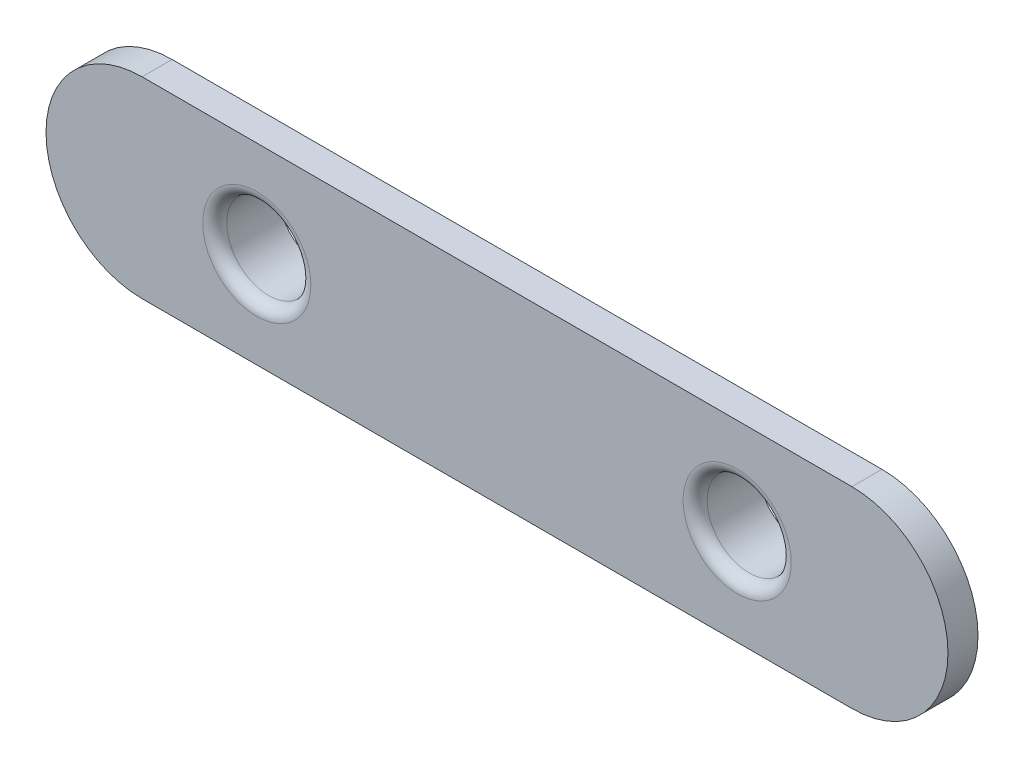
ISO-10303-21;
HEADER;
FILE_DESCRIPTION(('STEP AP214'),'2;1');
FILE_NAME('part.step','',(''),(''),'','','');
FILE_SCHEMA(('AUTOMOTIVE_DESIGN { 1 0 10303 214 1 1 1 1 }'));
ENDSEC;
DATA;
#1=APPLICATION_CONTEXT('core data for automotive mechanical design processes');
#2=APPLICATION_PROTOCOL_DEFINITION('international standard','automotive_design',2000,#1);
#3=PRODUCT_CONTEXT('',#1,'mechanical');
#4=PRODUCT('Part','Part','',(#3));
#5=PRODUCT_RELATED_PRODUCT_CATEGORY('part','',(#4));
#6=PRODUCT_DEFINITION_FORMATION('','',#4);
#7=PRODUCT_DEFINITION_CONTEXT('part definition',#1,'design');
#8=PRODUCT_DEFINITION('design','',#6,#7);
#9=PRODUCT_DEFINITION_SHAPE('','',#8);
#10=(LENGTH_UNIT() NAMED_UNIT(*) SI_UNIT(.MILLI.,.METRE.));
#11=(NAMED_UNIT(*) PLANE_ANGLE_UNIT() SI_UNIT($,.RADIAN.));
#12=(NAMED_UNIT(*) SI_UNIT($,.STERADIAN.) SOLID_ANGLE_UNIT());
#13=UNCERTAINTY_MEASURE_WITH_UNIT(LENGTH_MEASURE(1.E-05),#10,'distance_accuracy_value','');
#14=(GEOMETRIC_REPRESENTATION_CONTEXT(3) GLOBAL_UNCERTAINTY_ASSIGNED_CONTEXT((#13)) GLOBAL_UNIT_ASSIGNED_CONTEXT((#10,
#11,#12)) REPRESENTATION_CONTEXT('',''));
#15=CARTESIAN_POINT('',(0.,0.,0.));
#16=DIRECTION('',(0.,0.,1.));
#17=DIRECTION('',(1.,0.,0.));
#18=AXIS2_PLACEMENT_3D('',#15,#16,#17);
#19=CARTESIAN_POINT('',(-29.55,0.,0.));
#20=DIRECTION('',(0.,0.,1.));
#21=DIRECTION('',(1.,0.,0.));
#22=AXIS2_PLACEMENT_3D('',#19,#20,#21);
#23=PLANE('',#22);
#24=CARTESIAN_POINT('',(20.,0.,0.));
#25=DIRECTION('',(0.,0.,1.));
#26=DIRECTION('',(1.,0.,0.));
#27=AXIS2_PLACEMENT_3D('',#24,#25,#26);
#28=CIRCLE('',#27,4.5);
#29=CARTESIAN_POINT('',(24.5,0.,0.));
#30=VERTEX_POINT('',#29);
#31=EDGE_CURVE('E94',#30,#30,#28,.F.);
#32=ORIENTED_EDGE('',*,*,#31,.F.);
#33=EDGE_LOOP('',(#32));
#34=FACE_BOUND('',#33,.T.);
#35=CARTESIAN_POINT('',(-29.55,0.,0.));
#36=DIRECTION('',(0.,0.,1.));
#37=DIRECTION('',(1.,0.,0.));
#38=AXIS2_PLACEMENT_3D('',#35,#36,#37);
#39=CIRCLE('',#38,8.);
#40=CARTESIAN_POINT('',(-29.55,7.99999999999999,0.));
#41=VERTEX_POINT('',#40);
#42=CARTESIAN_POINT('',(-29.55,-8.00000000000001,0.));
#43=VERTEX_POINT('',#42);
#44=EDGE_CURVE('E84',#41,#43,#39,.T.);
#45=ORIENTED_EDGE('',*,*,#44,.F.);
#46=DIRECTION('',(-1.,0.,0.));
#47=VECTOR('',#46,1.);
#48=CARTESIAN_POINT('',(-29.55,7.99999999999999,0.));
#49=LINE('',#48,#47);
#50=CARTESIAN_POINT('',(29.55,7.99999999999999,0.));
#51=VERTEX_POINT('',#50);
#52=EDGE_CURVE('E56',#51,#41,#49,.T.);
#53=ORIENTED_EDGE('',*,*,#52,.F.);
#54=CARTESIAN_POINT('',(29.55,0.,0.));
#55=DIRECTION('',(0.,0.,1.));
#56=DIRECTION('',(1.,0.,0.));
#57=AXIS2_PLACEMENT_3D('',#54,#55,#56);
#58=CIRCLE('',#57,8.);
#59=CARTESIAN_POINT('',(29.55,-7.99999999999999,0.));
#60=VERTEX_POINT('',#59);
#61=EDGE_CURVE('E50',#60,#51,#58,.T.);
#62=ORIENTED_EDGE('',*,*,#61,.F.);
#63=DIRECTION('',(1.,0.,0.));
#64=VECTOR('',#63,1.);
#65=CARTESIAN_POINT('',(-29.55,-8.00000000000001,0.));
#66=LINE('',#65,#64);
#67=EDGE_CURVE('E74',#43,#60,#66,.T.);
#68=ORIENTED_EDGE('',*,*,#67,.F.);
#69=EDGE_LOOP('',(#45,#53,#62,#68));
#70=FACE_BOUND('',#69,.T.);
#71=CARTESIAN_POINT('',(-20.,0.,0.));
#72=DIRECTION('',(0.,0.,1.));
#73=DIRECTION('',(1.,0.,0.));
#74=AXIS2_PLACEMENT_3D('',#71,#72,#73);
#75=CIRCLE('',#74,4.5);
#76=CARTESIAN_POINT('',(-15.5,0.,0.));
#77=VERTEX_POINT('',#76);
#78=EDGE_CURVE('E97',#77,#77,#75,.F.);
#79=ORIENTED_EDGE('',*,*,#78,.F.);
#80=EDGE_LOOP('',(#79));
#81=FACE_BOUND('',#80,.T.);
#82=ADVANCED_FACE('F16',(#34,#70,#81),#23,.F.);
#83=CARTESIAN_POINT('',(-29.55,0.,2.5));
#84=DIRECTION('',(0.,0.,1.));
#85=DIRECTION('',(1.,0.,0.));
#86=AXIS2_PLACEMENT_3D('',#83,#84,#85);
#87=PLANE('',#86);
#88=CARTESIAN_POINT('',(20.,0.,2.5));
#89=DIRECTION('',(0.,0.,1.));
#90=DIRECTION('',(1.,0.,0.));
#91=AXIS2_PLACEMENT_3D('',#88,#89,#90);
#92=CIRCLE('',#91,4.5);
#93=CARTESIAN_POINT('',(24.5,0.,2.5));
#94=VERTEX_POINT('',#93);
#95=EDGE_CURVE('E25',#94,#94,#92,.F.);
#96=ORIENTED_EDGE('',*,*,#95,.T.);
#97=EDGE_LOOP('',(#96));
#98=FACE_BOUND('',#97,.T.);
#99=CARTESIAN_POINT('',(-20.,0.,2.5));
#100=DIRECTION('',(0.,0.,1.));
#101=DIRECTION('',(1.,0.,0.));
#102=AXIS2_PLACEMENT_3D('',#99,#100,#101);
#103=CIRCLE('',#102,4.5);
#104=CARTESIAN_POINT('',(-15.5,0.,2.5));
#105=VERTEX_POINT('',#104);
#106=EDGE_CURVE('E103',#105,#105,#103,.F.);
#107=ORIENTED_EDGE('',*,*,#106,.T.);
#108=EDGE_LOOP('',(#107));
#109=FACE_BOUND('',#108,.T.);
#110=CARTESIAN_POINT('',(-29.55,0.,2.5));
#111=DIRECTION('',(0.,0.,1.));
#112=DIRECTION('',(1.,0.,0.));
#113=AXIS2_PLACEMENT_3D('',#110,#111,#112);
#114=CIRCLE('',#113,8.);
#115=CARTESIAN_POINT('',(-29.55,7.99999999999999,2.5));
#116=VERTEX_POINT('',#115);
#117=CARTESIAN_POINT('',(-29.55,-8.00000000000001,2.5));
#118=VERTEX_POINT('',#117);
#119=EDGE_CURVE('E69',#116,#118,#114,.T.);
#120=ORIENTED_EDGE('',*,*,#119,.T.);
#121=DIRECTION('',(1.,0.,0.));
#122=VECTOR('',#121,1.);
#123=CARTESIAN_POINT('',(-29.55,-8.00000000000001,2.5));
#124=LINE('',#123,#122);
#125=CARTESIAN_POINT('',(29.55,-7.99999999999999,2.5));
#126=VERTEX_POINT('',#125);
#127=EDGE_CURVE('E64',#118,#126,#124,.T.);
#128=ORIENTED_EDGE('',*,*,#127,.T.);
#129=CARTESIAN_POINT('',(29.55,0.,2.5));
#130=DIRECTION('',(0.,0.,1.));
#131=DIRECTION('',(1.,0.,0.));
#132=AXIS2_PLACEMENT_3D('',#129,#130,#131);
#133=CIRCLE('',#132,8.);
#134=CARTESIAN_POINT('',(29.55,7.99999999999999,2.5));
#135=VERTEX_POINT('',#134);
#136=EDGE_CURVE('E67',#126,#135,#133,.T.);
#137=ORIENTED_EDGE('',*,*,#136,.T.);
#138=DIRECTION('',(-1.,0.,0.));
#139=VECTOR('',#138,1.);
#140=CARTESIAN_POINT('',(-29.55,7.99999999999999,2.5));
#141=LINE('',#140,#139);
#142=EDGE_CURVE('E33',#135,#116,#141,.T.);
#143=ORIENTED_EDGE('',*,*,#142,.T.);
#144=EDGE_LOOP('',(#120,#128,#137,#143));
#145=FACE_BOUND('',#144,.T.);
#146=ADVANCED_FACE('F65',(#98,#109,#145),#87,.T.);
#147=CARTESIAN_POINT('',(-29.55,0.,2.5));
#148=DIRECTION('',(0.,0.,-1.));
#149=DIRECTION('',(-1.,0.,0.));
#150=AXIS2_PLACEMENT_3D('',#147,#148,#149);
#151=CYLINDRICAL_SURFACE('',#150,8.);
#152=ORIENTED_EDGE('',*,*,#44,.T.);
#153=DIRECTION('',(0.,0.,-1.));
#154=VECTOR('',#153,1.);
#155=CARTESIAN_POINT('',(-29.55,-8.00000000000001,2.5));
#156=LINE('',#155,#154);
#157=EDGE_CURVE('E75',#118,#43,#156,.T.);
#158=ORIENTED_EDGE('',*,*,#157,.F.);
#159=ORIENTED_EDGE('',*,*,#119,.F.);
#160=DIRECTION('',(0.,0.,-1.));
#161=VECTOR('',#160,1.);
#162=CARTESIAN_POINT('',(-29.55,7.99999999999999,2.5));
#163=LINE('',#162,#161);
#164=EDGE_CURVE('E80',#116,#41,#163,.T.);
#165=ORIENTED_EDGE('',*,*,#164,.T.);
#166=EDGE_LOOP('',(#152,#158,#159,#165));
#167=FACE_BOUND('',#166,.T.);
#168=ADVANCED_FACE('F158',(#167),#151,.T.);
#169=CARTESIAN_POINT('',(-29.55,-8.00000000000001,2.5));
#170=DIRECTION('',(0.,1.,0.));
#171=DIRECTION('',(0.,0.,1.));
#172=AXIS2_PLACEMENT_3D('',#169,#170,#171);
#173=PLANE('',#172);
#174=ORIENTED_EDGE('',*,*,#67,.T.);
#175=DIRECTION('',(0.,0.,-1.));
#176=VECTOR('',#175,1.);
#177=CARTESIAN_POINT('',(29.55,-7.99999999999999,2.5));
#178=LINE('',#177,#176);
#179=EDGE_CURVE('E72',#126,#60,#178,.T.);
#180=ORIENTED_EDGE('',*,*,#179,.F.);
#181=ORIENTED_EDGE('',*,*,#127,.F.);
#182=ORIENTED_EDGE('',*,*,#157,.T.);
#183=EDGE_LOOP('',(#174,#180,#181,#182));
#184=FACE_BOUND('',#183,.T.);
#185=ADVANCED_FACE('F73',(#184),#173,.F.);
#186=CARTESIAN_POINT('',(29.55,0.,2.5));
#187=DIRECTION('',(0.,0.,-1.));
#188=DIRECTION('',(-1.,0.,0.));
#189=AXIS2_PLACEMENT_3D('',#186,#187,#188);
#190=CYLINDRICAL_SURFACE('',#189,8.);
#191=ORIENTED_EDGE('',*,*,#61,.T.);
#192=DIRECTION('',(0.,0.,-1.));
#193=VECTOR('',#192,1.);
#194=CARTESIAN_POINT('',(29.55,7.99999999999999,2.5));
#195=LINE('',#194,#193);
#196=EDGE_CURVE('E76',#135,#51,#195,.T.);
#197=ORIENTED_EDGE('',*,*,#196,.F.);
#198=ORIENTED_EDGE('',*,*,#136,.F.);
#199=ORIENTED_EDGE('',*,*,#179,.T.);
#200=EDGE_LOOP('',(#191,#197,#198,#199));
#201=FACE_BOUND('',#200,.T.);
#202=ADVANCED_FACE('F78',(#201),#190,.T.);
#203=CARTESIAN_POINT('',(-29.55,7.99999999999999,2.5));
#204=DIRECTION('',(0.,-1.,0.));
#205=DIRECTION('',(1.,0.,0.));
#206=AXIS2_PLACEMENT_3D('',#203,#204,#205);
#207=PLANE('',#206);
#208=ORIENTED_EDGE('',*,*,#52,.T.);
#209=ORIENTED_EDGE('',*,*,#164,.F.);
#210=ORIENTED_EDGE('',*,*,#142,.F.);
#211=ORIENTED_EDGE('',*,*,#196,.T.);
#212=EDGE_LOOP('',(#208,#209,#210,#211));
#213=FACE_BOUND('',#212,.T.);
#214=ADVANCED_FACE('F164',(#213),#207,.F.);
#215=CARTESIAN_POINT('',(-20.,0.,2.5));
#216=DIRECTION('',(0.,0.,-1.));
#217=DIRECTION('',(-1.,0.,0.));
#218=AXIS2_PLACEMENT_3D('',#215,#216,#217);
#219=CYLINDRICAL_SURFACE('',#218,3.5);
#220=CARTESIAN_POINT('',(-20.,0.,1.5));
#221=DIRECTION('',(0.,0.,1.));
#222=DIRECTION('',(1.,0.,0.));
#223=AXIS2_PLACEMENT_3D('',#220,#221,#222);
#224=CIRCLE('',#223,3.5);
#225=CARTESIAN_POINT('',(-16.5,0.,1.5));
#226=VERTEX_POINT('',#225);
#227=EDGE_CURVE('E10',#226,#226,#224,.T.);
#228=ORIENTED_EDGE('',*,*,#227,.T.);
#229=EDGE_LOOP('',(#228));
#230=FACE_BOUND('',#229,.T.);
#231=CARTESIAN_POINT('',(-20.,0.,-2.8));
#232=DIRECTION('',(0.,0.,-1.));
#233=DIRECTION('',(-1.,0.,0.));
#234=AXIS2_PLACEMENT_3D('',#231,#232,#233);
#235=CIRCLE('',#234,3.5);
#236=CARTESIAN_POINT('',(-23.5,0.,-2.8));
#237=VERTEX_POINT('',#236);
#238=EDGE_CURVE('E131',#237,#237,#235,.T.);
#239=ORIENTED_EDGE('',*,*,#238,.T.);
#240=EDGE_LOOP('',(#239));
#241=FACE_BOUND('',#240,.T.);
#242=ADVANCED_FACE('F120',(#230,#241),#219,.F.);
#243=CARTESIAN_POINT('',(20.,0.,2.5));
#244=DIRECTION('',(0.,0.,-1.));
#245=DIRECTION('',(-1.,0.,0.));
#246=AXIS2_PLACEMENT_3D('',#243,#244,#245);
#247=CYLINDRICAL_SURFACE('',#246,3.5);
#248=CARTESIAN_POINT('',(20.,0.,1.5));
#249=DIRECTION('',(0.,0.,1.));
#250=DIRECTION('',(1.,0.,0.));
#251=AXIS2_PLACEMENT_3D('',#248,#249,#250);
#252=CIRCLE('',#251,3.5);
#253=CARTESIAN_POINT('',(23.5,0.,1.5));
#254=VERTEX_POINT('',#253);
#255=EDGE_CURVE('E100',#254,#254,#252,.T.);
#256=ORIENTED_EDGE('',*,*,#255,.T.);
#257=EDGE_LOOP('',(#256));
#258=FACE_BOUND('',#257,.T.);
#259=CARTESIAN_POINT('',(20.,0.,-2.8));
#260=DIRECTION('',(0.,0.,-1.));
#261=DIRECTION('',(-1.,0.,0.));
#262=AXIS2_PLACEMENT_3D('',#259,#260,#261);
#263=CIRCLE('',#262,3.5);
#264=CARTESIAN_POINT('',(16.5,0.,-2.8));
#265=VERTEX_POINT('',#264);
#266=EDGE_CURVE('E124',#265,#265,#263,.T.);
#267=ORIENTED_EDGE('',*,*,#266,.T.);
#268=EDGE_LOOP('',(#267));
#269=FACE_BOUND('',#268,.T.);
#270=ADVANCED_FACE('F116',(#258,#269),#247,.F.);
#271=CARTESIAN_POINT('',(20.,0.,-2.8));
#272=DIRECTION('',(0.,0.,-1.));
#273=DIRECTION('',(-1.,0.,0.));
#274=AXIS2_PLACEMENT_3D('',#271,#272,#273);
#275=PLANE('',#274);
#276=CARTESIAN_POINT('',(20.,0.,-2.8));
#277=DIRECTION('',(0.,0.,-1.));
#278=DIRECTION('',(-1.,0.,0.));
#279=AXIS2_PLACEMENT_3D('',#276,#277,#278);
#280=CIRCLE('',#279,4.5);
#281=CARTESIAN_POINT('',(15.5,0.,-2.8));
#282=VERTEX_POINT('',#281);
#283=EDGE_CURVE('E87',#282,#282,#280,.T.);
#284=ORIENTED_EDGE('',*,*,#283,.T.);
#285=EDGE_LOOP('',(#284));
#286=FACE_BOUND('',#285,.T.);
#287=ORIENTED_EDGE('',*,*,#266,.F.);
#288=EDGE_LOOP('',(#287));
#289=FACE_BOUND('',#288,.T.);
#290=ADVANCED_FACE('F119',(#286,#289),#275,.T.);
#291=CARTESIAN_POINT('',(20.,0.,-2.8));
#292=DIRECTION('',(0.,0.,1.));
#293=DIRECTION('',(1.,0.,0.));
#294=AXIS2_PLACEMENT_3D('',#291,#292,#293);
#295=CYLINDRICAL_SURFACE('',#294,4.5);
#296=ORIENTED_EDGE('',*,*,#283,.F.);
#297=EDGE_LOOP('',(#296));
#298=FACE_BOUND('',#297,.T.);
#299=ORIENTED_EDGE('',*,*,#31,.T.);
#300=EDGE_LOOP('',(#299));
#301=FACE_BOUND('',#300,.T.);
#302=ADVANCED_FACE('F140',(#298,#301),#295,.T.);
#303=CARTESIAN_POINT('',(-20.,0.,-2.8));
#304=DIRECTION('',(0.,0.,-1.));
#305=DIRECTION('',(-1.,0.,0.));
#306=AXIS2_PLACEMENT_3D('',#303,#304,#305);
#307=PLANE('',#306);
#308=CARTESIAN_POINT('',(-20.,0.,-2.8));
#309=DIRECTION('',(0.,0.,-1.));
#310=DIRECTION('',(-1.,0.,0.));
#311=AXIS2_PLACEMENT_3D('',#308,#309,#310);
#312=CIRCLE('',#311,4.5);
#313=CARTESIAN_POINT('',(-24.5,0.,-2.8));
#314=VERTEX_POINT('',#313);
#315=EDGE_CURVE('E126',#314,#314,#312,.T.);
#316=ORIENTED_EDGE('',*,*,#315,.T.);
#317=EDGE_LOOP('',(#316));
#318=FACE_BOUND('',#317,.T.);
#319=ORIENTED_EDGE('',*,*,#238,.F.);
#320=EDGE_LOOP('',(#319));
#321=FACE_BOUND('',#320,.T.);
#322=ADVANCED_FACE('F138',(#318,#321),#307,.T.);
#323=CARTESIAN_POINT('',(-20.,0.,-2.8));
#324=DIRECTION('',(0.,0.,1.));
#325=DIRECTION('',(1.,0.,0.));
#326=AXIS2_PLACEMENT_3D('',#323,#324,#325);
#327=CYLINDRICAL_SURFACE('',#326,4.5);
#328=ORIENTED_EDGE('',*,*,#315,.F.);
#329=EDGE_LOOP('',(#328));
#330=FACE_BOUND('',#329,.T.);
#331=ORIENTED_EDGE('',*,*,#78,.T.);
#332=EDGE_LOOP('',(#331));
#333=FACE_BOUND('',#332,.T.);
#334=ADVANCED_FACE('F113',(#330,#333),#327,.T.);
#335=CARTESIAN_POINT('',(20.,0.,1.5));
#336=DIRECTION('',(0.,0.,1.));
#337=DIRECTION('',(1.,0.,0.));
#338=AXIS2_PLACEMENT_3D('',#335,#336,#337);
#339=TOROIDAL_SURFACE('',#338,4.5,1.);
#340=ORIENTED_EDGE('',*,*,#95,.F.);
#341=EDGE_LOOP('',(#340));
#342=FACE_BOUND('',#341,.T.);
#343=ORIENTED_EDGE('',*,*,#255,.F.);
#344=EDGE_LOOP('',(#343));
#345=FACE_BOUND('',#344,.T.);
#346=ADVANCED_FACE('F110',(#342,#345),#339,.T.);
#347=CARTESIAN_POINT('',(-20.,0.,1.5));
#348=DIRECTION('',(0.,0.,1.));
#349=DIRECTION('',(1.,0.,0.));
#350=AXIS2_PLACEMENT_3D('',#347,#348,#349);
#351=TOROIDAL_SURFACE('',#350,4.5,1.);
#352=ORIENTED_EDGE('',*,*,#106,.F.);
#353=EDGE_LOOP('',(#352));
#354=FACE_BOUND('',#353,.T.);
#355=ORIENTED_EDGE('',*,*,#227,.F.);
#356=EDGE_LOOP('',(#355));
#357=FACE_BOUND('',#356,.T.);
#358=ADVANCED_FACE('F18',(#354,#357),#351,.T.);
#359=CLOSED_SHELL('',(#82,#146,#168,#185,#202,#214,#242,#270,#290,#302,#322,#334,#346,#358));
#360=MANIFOLD_SOLID_BREP('B1',#359);
#361=ADVANCED_BREP_SHAPE_REPRESENTATION('',(#18,#360),#14);
#362=SHAPE_DEFINITION_REPRESENTATION(#9,#361);
ENDSEC;
END-ISO-10303-21;
